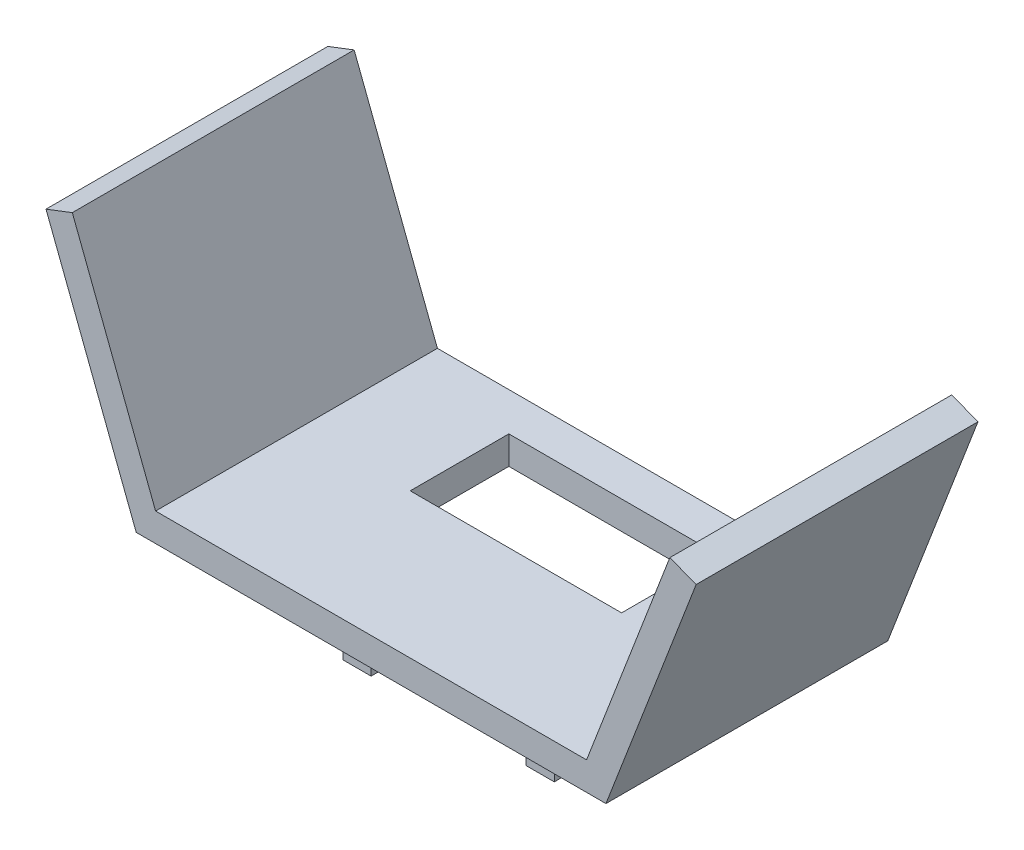
ISO-10303-21;
HEADER;
FILE_DESCRIPTION(('STEP AP214'),'2;1');
FILE_NAME('part.step','',(''),(''),'','','');
FILE_SCHEMA(('AUTOMOTIVE_DESIGN { 1 0 10303 214 1 1 1 1 }'));
ENDSEC;
DATA;
#1=APPLICATION_CONTEXT('core data for automotive mechanical design processes');
#2=APPLICATION_PROTOCOL_DEFINITION('international standard','automotive_design',2000,#1);
#3=PRODUCT_CONTEXT('',#1,'mechanical');
#4=PRODUCT('Part','Part','',(#3));
#5=PRODUCT_RELATED_PRODUCT_CATEGORY('part','',(#4));
#6=PRODUCT_DEFINITION_FORMATION('','',#4);
#7=PRODUCT_DEFINITION_CONTEXT('part definition',#1,'design');
#8=PRODUCT_DEFINITION('design','',#6,#7);
#9=PRODUCT_DEFINITION_SHAPE('','',#8);
#10=(LENGTH_UNIT() NAMED_UNIT(*) SI_UNIT(.MILLI.,.METRE.));
#11=(NAMED_UNIT(*) PLANE_ANGLE_UNIT() SI_UNIT($,.RADIAN.));
#12=(NAMED_UNIT(*) SI_UNIT($,.STERADIAN.) SOLID_ANGLE_UNIT());
#13=UNCERTAINTY_MEASURE_WITH_UNIT(LENGTH_MEASURE(1.E-05),#10,'distance_accuracy_value','');
#14=(GEOMETRIC_REPRESENTATION_CONTEXT(3) GLOBAL_UNCERTAINTY_ASSIGNED_CONTEXT((#13)) GLOBAL_UNIT_ASSIGNED_CONTEXT((#10,
#11,#12)) REPRESENTATION_CONTEXT('',''));
#15=CARTESIAN_POINT('',(0.,0.,0.));
#16=DIRECTION('',(0.,0.,1.));
#17=DIRECTION('',(1.,0.,0.));
#18=AXIS2_PLACEMENT_3D('',#15,#16,#17);
#19=CARTESIAN_POINT('',(50.,0.,60.));
#20=DIRECTION('',(0.,1.,0.));
#21=DIRECTION('',(0.,0.,1.));
#22=AXIS2_PLACEMENT_3D('',#19,#20,#21);
#23=PLANE('',#22);
#24=DIRECTION('',(-1.,0.,0.));
#25=VECTOR('',#24,1.);
#26=CARTESIAN_POINT('',(-16.5,0.,43.5));
#27=LINE('',#26,#25);
#28=CARTESIAN_POINT('',(-16.5,0.,43.5));
#29=VERTEX_POINT('',#28);
#30=CARTESIAN_POINT('',(-22.5,0.,43.5));
#31=VERTEX_POINT('',#30);
#32=EDGE_CURVE('E201',#29,#31,#27,.T.);
#33=ORIENTED_EDGE('',*,*,#32,.F.);
#34=DIRECTION('',(0.,0.,1.));
#35=VECTOR('',#34,1.);
#36=CARTESIAN_POINT('',(-16.5,0.,37.5));
#37=LINE('',#36,#35);
#38=CARTESIAN_POINT('',(-16.5,0.,37.5));
#39=VERTEX_POINT('',#38);
#40=EDGE_CURVE('E217',#39,#29,#37,.T.);
#41=ORIENTED_EDGE('',*,*,#40,.F.);
#42=DIRECTION('',(1.,0.,0.));
#43=VECTOR('',#42,1.);
#44=CARTESIAN_POINT('',(-22.5,0.,37.5));
#45=LINE('',#44,#43);
#46=CARTESIAN_POINT('',(-22.5,0.,37.5));
#47=VERTEX_POINT('',#46);
#48=EDGE_CURVE('E230',#47,#39,#45,.T.);
#49=ORIENTED_EDGE('',*,*,#48,.F.);
#50=DIRECTION('',(0.,0.,-1.));
#51=VECTOR('',#50,1.);
#52=CARTESIAN_POINT('',(-22.5,0.,43.5));
#53=LINE('',#52,#51);
#54=EDGE_CURVE('E206',#31,#47,#53,.T.);
#55=ORIENTED_EDGE('',*,*,#54,.F.);
#56=EDGE_LOOP('',(#33,#41,#49,#55));
#57=FACE_BOUND('',#56,.T.);
#58=DIRECTION('',(1.,0.,0.));
#59=VECTOR('',#58,1.);
#60=CARTESIAN_POINT('',(22.5,0.,8.16910987885628));
#61=LINE('',#60,#59);
#62=CARTESIAN_POINT('',(-22.5,0.,8.16910987885628));
#63=VERTEX_POINT('',#62);
#64=CARTESIAN_POINT('',(22.5,0.,8.16910987885628));
#65=VERTEX_POINT('',#64);
#66=EDGE_CURVE('E273',#63,#65,#61,.T.);
#67=ORIENTED_EDGE('',*,*,#66,.F.);
#68=DIRECTION('',(0.,0.,-1.));
#69=VECTOR('',#68,1.);
#70=CARTESIAN_POINT('',(-22.5,0.,8.16910987885628));
#71=LINE('',#70,#69);
#72=CARTESIAN_POINT('',(-22.5,0.,29.1691098788563));
#73=VERTEX_POINT('',#72);
#74=EDGE_CURVE('E252',#73,#63,#71,.T.);
#75=ORIENTED_EDGE('',*,*,#74,.F.);
#76=DIRECTION('',(-1.,0.,0.));
#77=VECTOR('',#76,1.);
#78=CARTESIAN_POINT('',(-22.5,0.,29.1691098788563));
#79=LINE('',#78,#77);
#80=CARTESIAN_POINT('',(22.5,0.,29.1691098788563));
#81=VERTEX_POINT('',#80);
#82=EDGE_CURVE('E258',#81,#73,#79,.T.);
#83=ORIENTED_EDGE('',*,*,#82,.F.);
#84=DIRECTION('',(0.,0.,1.));
#85=VECTOR('',#84,1.);
#86=CARTESIAN_POINT('',(22.5,0.,8.16910987885628));
#87=LINE('',#86,#85);
#88=EDGE_CURVE('E277',#65,#81,#87,.T.);
#89=ORIENTED_EDGE('',*,*,#88,.F.);
#90=EDGE_LOOP('',(#67,#75,#83,#89));
#91=FACE_BOUND('',#90,.T.);
#92=DIRECTION('',(1.,0.,0.));
#93=VECTOR('',#92,1.);
#94=CARTESIAN_POINT('',(50.,0.,0.));
#95=LINE('',#94,#93);
#96=CARTESIAN_POINT('',(-50.,0.,0.));
#97=VERTEX_POINT('',#96);
#98=CARTESIAN_POINT('',(50.,0.,0.));
#99=VERTEX_POINT('',#98);
#100=EDGE_CURVE('E327',#97,#99,#95,.T.);
#101=ORIENTED_EDGE('',*,*,#100,.T.);
#102=DIRECTION('',(0.,0.,-1.));
#103=VECTOR('',#102,1.);
#104=CARTESIAN_POINT('',(50.,0.,60.));
#105=LINE('',#104,#103);
#106=CARTESIAN_POINT('',(50.,0.,60.));
#107=VERTEX_POINT('',#106);
#108=EDGE_CURVE('E48',#107,#99,#105,.T.);
#109=ORIENTED_EDGE('',*,*,#108,.F.);
#110=DIRECTION('',(1.,0.,0.));
#111=VECTOR('',#110,1.);
#112=CARTESIAN_POINT('',(50.,0.,60.));
#113=LINE('',#112,#111);
#114=CARTESIAN_POINT('',(-50.,0.,60.));
#115=VERTEX_POINT('',#114);
#116=EDGE_CURVE('E301',#115,#107,#113,.T.);
#117=ORIENTED_EDGE('',*,*,#116,.F.);
#118=DIRECTION('',(0.,0.,-1.));
#119=VECTOR('',#118,1.);
#120=CARTESIAN_POINT('',(-50.,0.,60.));
#121=LINE('',#120,#119);
#122=EDGE_CURVE('E11',#115,#97,#121,.T.);
#123=ORIENTED_EDGE('',*,*,#122,.T.);
#124=EDGE_LOOP('',(#101,#109,#117,#123));
#125=FACE_BOUND('',#124,.T.);
#126=DIRECTION('',(0.,0.,-1.));
#127=VECTOR('',#126,1.);
#128=CARTESIAN_POINT('',(16.5,0.,37.5));
#129=LINE('',#128,#127);
#130=CARTESIAN_POINT('',(16.5,0.,43.5));
#131=VERTEX_POINT('',#130);
#132=CARTESIAN_POINT('',(16.5,0.,37.5));
#133=VERTEX_POINT('',#132);
#134=EDGE_CURVE('E199',#131,#133,#129,.T.);
#135=ORIENTED_EDGE('',*,*,#134,.F.);
#136=DIRECTION('',(-1.,0.,0.));
#137=VECTOR('',#136,1.);
#138=CARTESIAN_POINT('',(16.5,0.,43.5));
#139=LINE('',#138,#137);
#140=CARTESIAN_POINT('',(22.5,0.,43.5));
#141=VERTEX_POINT('',#140);
#142=EDGE_CURVE('E196',#141,#131,#139,.T.);
#143=ORIENTED_EDGE('',*,*,#142,.F.);
#144=DIRECTION('',(0.,0.,1.));
#145=VECTOR('',#144,1.);
#146=CARTESIAN_POINT('',(22.5,0.,43.5));
#147=LINE('',#146,#145);
#148=CARTESIAN_POINT('',(22.5,0.,37.5));
#149=VERTEX_POINT('',#148);
#150=EDGE_CURVE('E60',#149,#141,#147,.T.);
#151=ORIENTED_EDGE('',*,*,#150,.F.);
#152=DIRECTION('',(1.,0.,0.));
#153=VECTOR('',#152,1.);
#154=CARTESIAN_POINT('',(22.5,0.,37.5));
#155=LINE('',#154,#153);
#156=EDGE_CURVE('E55',#133,#149,#155,.T.);
#157=ORIENTED_EDGE('',*,*,#156,.F.);
#158=EDGE_LOOP('',(#135,#143,#151,#157));
#159=FACE_BOUND('',#158,.T.);
#160=ADVANCED_FACE('F39',(#57,#91,#125,#159),#23,.F.);
#161=CARTESIAN_POINT('',(-50.,0.,60.));
#162=DIRECTION('',(0.93349549278669,0.358589131105412,0.));
#163=DIRECTION('',(-0.358589131105412,0.93349549278669,0.));
#164=AXIS2_PLACEMENT_3D('',#161,#162,#163);
#165=PLANE('',#164);
#166=DIRECTION('',(0.358589131105412,-0.93349549278669,0.));
#167=VECTOR('',#166,1.);
#168=CARTESIAN_POINT('',(-50.,0.,0.));
#169=LINE('',#168,#167);
#170=CARTESIAN_POINT('',(-69.2067949913151,50.,0.));
#171=VERTEX_POINT('',#170);
#172=EDGE_CURVE('E287',#171,#97,#169,.T.);
#173=ORIENTED_EDGE('',*,*,#172,.T.);
#174=ORIENTED_EDGE('',*,*,#122,.F.);
#175=DIRECTION('',(0.358589131105412,-0.93349549278669,0.));
#176=VECTOR('',#175,1.);
#177=CARTESIAN_POINT('',(-50.,0.,60.));
#178=LINE('',#177,#176);
#179=CARTESIAN_POINT('',(-69.2067949913151,50.,60.));
#180=VERTEX_POINT('',#179);
#181=EDGE_CURVE('E297',#180,#115,#178,.T.);
#182=ORIENTED_EDGE('',*,*,#181,.F.);
#183=DIRECTION('',(0.,0.,-1.));
#184=VECTOR('',#183,1.);
#185=CARTESIAN_POINT('',(-69.2067949913151,50.,60.));
#186=LINE('',#185,#184);
#187=EDGE_CURVE('E323',#180,#171,#186,.T.);
#188=ORIENTED_EDGE('',*,*,#187,.T.);
#189=EDGE_LOOP('',(#173,#174,#182,#188));
#190=FACE_BOUND('',#189,.T.);
#191=ADVANCED_FACE('F41',(#190),#165,.F.);
#192=CARTESIAN_POINT('',(50.,0.,60.));
#193=DIRECTION('',(-0.93349549278669,0.358589131105412,0.));
#194=DIRECTION('',(-0.358589131105412,-0.93349549278669,0.));
#195=AXIS2_PLACEMENT_3D('',#192,#193,#194);
#196=PLANE('',#195);
#197=DIRECTION('',(0.358589131105412,0.93349549278669,0.));
#198=VECTOR('',#197,1.);
#199=CARTESIAN_POINT('',(50.,0.,0.));
#200=LINE('',#199,#198);
#201=CARTESIAN_POINT('',(69.2067949913151,50.,0.));
#202=VERTEX_POINT('',#201);
#203=EDGE_CURVE('E330',#99,#202,#200,.T.);
#204=ORIENTED_EDGE('',*,*,#203,.T.);
#205=DIRECTION('',(0.,0.,-1.));
#206=VECTOR('',#205,1.);
#207=CARTESIAN_POINT('',(69.2067949913151,50.,60.));
#208=LINE('',#207,#206);
#209=CARTESIAN_POINT('',(69.2067949913151,50.,60.));
#210=VERTEX_POINT('',#209);
#211=EDGE_CURVE('E366',#210,#202,#208,.T.);
#212=ORIENTED_EDGE('',*,*,#211,.F.);
#213=DIRECTION('',(0.358589131105412,0.93349549278669,0.));
#214=VECTOR('',#213,1.);
#215=CARTESIAN_POINT('',(50.,0.,60.));
#216=LINE('',#215,#214);
#217=EDGE_CURVE('E305',#107,#210,#216,.T.);
#218=ORIENTED_EDGE('',*,*,#217,.F.);
#219=ORIENTED_EDGE('',*,*,#108,.T.);
#220=EDGE_LOOP('',(#204,#212,#218,#219));
#221=FACE_BOUND('',#220,.T.);
#222=ADVANCED_FACE('F375',(#221),#196,.F.);
#223=CARTESIAN_POINT('',(69.2067949913151,50.,60.));
#224=DIRECTION('',(-0.358589131105414,-0.93349549278669,0.));
#225=DIRECTION('',(0.93349549278669,-0.358589131105414,0.));
#226=AXIS2_PLACEMENT_3D('',#223,#224,#225);
#227=PLANE('',#226);
#228=DIRECTION('',(-0.93349549278669,0.358589131105414,0.));
#229=VECTOR('',#228,1.);
#230=CARTESIAN_POINT('',(69.2067949913151,50.,0.));
#231=LINE('',#230,#229);
#232=CARTESIAN_POINT('',(63.6058220345949,52.1515347866325,0.));
#233=VERTEX_POINT('',#232);
#234=EDGE_CURVE('E333',#202,#233,#231,.T.);
#235=ORIENTED_EDGE('',*,*,#234,.T.);
#236=DIRECTION('',(0.,0.,-1.));
#237=VECTOR('',#236,1.);
#238=CARTESIAN_POINT('',(63.6058220345949,52.1515347866325,60.));
#239=LINE('',#238,#237);
#240=CARTESIAN_POINT('',(63.6058220345949,52.1515347866325,60.));
#241=VERTEX_POINT('',#240);
#242=EDGE_CURVE('E362',#241,#233,#239,.T.);
#243=ORIENTED_EDGE('',*,*,#242,.F.);
#244=DIRECTION('',(-0.93349549278669,0.358589131105414,0.));
#245=VECTOR('',#244,1.);
#246=CARTESIAN_POINT('',(69.2067949913151,50.,60.));
#247=LINE('',#246,#245);
#248=EDGE_CURVE('E308',#210,#241,#247,.T.);
#249=ORIENTED_EDGE('',*,*,#248,.F.);
#250=ORIENTED_EDGE('',*,*,#211,.T.);
#251=EDGE_LOOP('',(#235,#243,#249,#250));
#252=FACE_BOUND('',#251,.T.);
#253=ADVANCED_FACE('F386',(#252),#227,.F.);
#254=CARTESIAN_POINT('',(63.6058220345949,52.1515347866325,60.));
#255=DIRECTION('',(0.93349549278669,-0.358589131105412,0.));
#256=DIRECTION('',(0.358589131105412,0.93349549278669,0.));
#257=AXIS2_PLACEMENT_3D('',#254,#255,#256);
#258=PLANE('',#257);
#259=DIRECTION('',(-0.358589131105412,-0.93349549278669,0.));
#260=VECTOR('',#259,1.);
#261=CARTESIAN_POINT('',(63.6058220345949,52.1515347866325,0.));
#262=LINE('',#261,#260);
#263=CARTESIAN_POINT('',(45.877360690967,5.99999999999999,0.));
#264=VERTEX_POINT('',#263);
#265=EDGE_CURVE('E336',#233,#264,#262,.T.);
#266=ORIENTED_EDGE('',*,*,#265,.T.);
#267=DIRECTION('',(0.,0.,-1.));
#268=VECTOR('',#267,1.);
#269=CARTESIAN_POINT('',(45.877360690967,5.99999999999999,60.));
#270=LINE('',#269,#268);
#271=CARTESIAN_POINT('',(45.877360690967,5.99999999999999,60.));
#272=VERTEX_POINT('',#271);
#273=EDGE_CURVE('E358',#272,#264,#270,.T.);
#274=ORIENTED_EDGE('',*,*,#273,.F.);
#275=DIRECTION('',(-0.358589131105412,-0.93349549278669,0.));
#276=VECTOR('',#275,1.);
#277=CARTESIAN_POINT('',(63.6058220345949,52.1515347866325,60.));
#278=LINE('',#277,#276);
#279=EDGE_CURVE('E311',#241,#272,#278,.T.);
#280=ORIENTED_EDGE('',*,*,#279,.F.);
#281=ORIENTED_EDGE('',*,*,#242,.T.);
#282=EDGE_LOOP('',(#266,#274,#280,#281));
#283=FACE_BOUND('',#282,.T.);
#284=ADVANCED_FACE('F390',(#283),#258,.F.);
#285=CARTESIAN_POINT('',(-45.877360690967,5.99999999999999,60.));
#286=DIRECTION('',(0.,-1.,0.));
#287=DIRECTION('',(0.,0.,-1.));
#288=AXIS2_PLACEMENT_3D('',#285,#286,#287);
#289=PLANE('',#288);
#290=DIRECTION('',(-1.,0.,0.));
#291=VECTOR('',#290,1.);
#292=CARTESIAN_POINT('',(-22.5,6.,29.1691098788563));
#293=LINE('',#292,#291);
#294=CARTESIAN_POINT('',(22.5,6.,29.1691098788563));
#295=VERTEX_POINT('',#294);
#296=CARTESIAN_POINT('',(-22.5,6.,29.1691098788563));
#297=VERTEX_POINT('',#296);
#298=EDGE_CURVE('E266',#295,#297,#293,.T.);
#299=ORIENTED_EDGE('',*,*,#298,.T.);
#300=DIRECTION('',(0.,0.,-1.));
#301=VECTOR('',#300,1.);
#302=CARTESIAN_POINT('',(-22.5,6.,8.16910987885628));
#303=LINE('',#302,#301);
#304=CARTESIAN_POINT('',(-22.5,6.,8.16910987885628));
#305=VERTEX_POINT('',#304);
#306=EDGE_CURVE('E253',#297,#305,#303,.T.);
#307=ORIENTED_EDGE('',*,*,#306,.T.);
#308=DIRECTION('',(1.,0.,0.));
#309=VECTOR('',#308,1.);
#310=CARTESIAN_POINT('',(22.5,6.,8.16910987885628));
#311=LINE('',#310,#309);
#312=CARTESIAN_POINT('',(22.5,5.99999999999999,8.16910987885628));
#313=VERTEX_POINT('',#312);
#314=EDGE_CURVE('E257',#305,#313,#311,.T.);
#315=ORIENTED_EDGE('',*,*,#314,.T.);
#316=DIRECTION('',(0.,0.,1.));
#317=VECTOR('',#316,1.);
#318=CARTESIAN_POINT('',(22.5,6.,8.16910987885628));
#319=LINE('',#318,#317);
#320=EDGE_CURVE('E262',#313,#295,#319,.T.);
#321=ORIENTED_EDGE('',*,*,#320,.T.);
#322=EDGE_LOOP('',(#299,#307,#315,#321));
#323=FACE_BOUND('',#322,.T.);
#324=DIRECTION('',(-1.,0.,0.));
#325=VECTOR('',#324,1.);
#326=CARTESIAN_POINT('',(-45.877360690967,5.99999999999999,0.));
#327=LINE('',#326,#325);
#328=CARTESIAN_POINT('',(-45.877360690967,5.99999999999999,0.));
#329=VERTEX_POINT('',#328);
#330=EDGE_CURVE('E339',#264,#329,#327,.T.);
#331=ORIENTED_EDGE('',*,*,#330,.T.);
#332=DIRECTION('',(0.,0.,-1.));
#333=VECTOR('',#332,1.);
#334=CARTESIAN_POINT('',(-45.877360690967,5.99999999999999,60.));
#335=LINE('',#334,#333);
#336=CARTESIAN_POINT('',(-45.877360690967,5.99999999999999,60.));
#337=VERTEX_POINT('',#336);
#338=EDGE_CURVE('E354',#337,#329,#335,.T.);
#339=ORIENTED_EDGE('',*,*,#338,.F.);
#340=DIRECTION('',(-1.,0.,0.));
#341=VECTOR('',#340,1.);
#342=CARTESIAN_POINT('',(-45.877360690967,5.99999999999999,60.));
#343=LINE('',#342,#341);
#344=EDGE_CURVE('E314',#272,#337,#343,.T.);
#345=ORIENTED_EDGE('',*,*,#344,.F.);
#346=ORIENTED_EDGE('',*,*,#273,.T.);
#347=EDGE_LOOP('',(#331,#339,#345,#346));
#348=FACE_BOUND('',#347,.T.);
#349=ADVANCED_FACE('F410',(#323,#348),#289,.F.);
#350=CARTESIAN_POINT('',(-63.6058220345949,52.1515347866325,60.));
#351=DIRECTION('',(-0.93349549278669,-0.358589131105412,0.));
#352=DIRECTION('',(0.358589131105412,-0.93349549278669,0.));
#353=AXIS2_PLACEMENT_3D('',#350,#351,#352);
#354=PLANE('',#353);
#355=DIRECTION('',(-0.358589131105412,0.93349549278669,0.));
#356=VECTOR('',#355,1.);
#357=CARTESIAN_POINT('',(-63.6058220345949,52.1515347866325,0.));
#358=LINE('',#357,#356);
#359=CARTESIAN_POINT('',(-63.6058220345949,52.1515347866325,0.));
#360=VERTEX_POINT('',#359);
#361=EDGE_CURVE('E342',#329,#360,#358,.T.);
#362=ORIENTED_EDGE('',*,*,#361,.T.);
#363=DIRECTION('',(0.,0.,-1.));
#364=VECTOR('',#363,1.);
#365=CARTESIAN_POINT('',(-63.6058220345949,52.1515347866325,60.));
#366=LINE('',#365,#364);
#367=CARTESIAN_POINT('',(-63.6058220345949,52.1515347866325,60.));
#368=VERTEX_POINT('',#367);
#369=EDGE_CURVE('E350',#368,#360,#366,.T.);
#370=ORIENTED_EDGE('',*,*,#369,.F.);
#371=DIRECTION('',(-0.358589131105412,0.93349549278669,0.));
#372=VECTOR('',#371,1.);
#373=CARTESIAN_POINT('',(-63.6058220345949,52.1515347866325,60.));
#374=LINE('',#373,#372);
#375=EDGE_CURVE('E317',#337,#368,#374,.T.);
#376=ORIENTED_EDGE('',*,*,#375,.F.);
#377=ORIENTED_EDGE('',*,*,#338,.T.);
#378=EDGE_LOOP('',(#362,#370,#376,#377));
#379=FACE_BOUND('',#378,.T.);
#380=ADVANCED_FACE('F408',(#379),#354,.F.);
#381=CARTESIAN_POINT('',(-69.2067949913151,50.,60.));
#382=DIRECTION('',(0.358589131105414,-0.93349549278669,0.));
#383=DIRECTION('',(0.93349549278669,0.358589131105414,0.));
#384=AXIS2_PLACEMENT_3D('',#381,#382,#383);
#385=PLANE('',#384);
#386=DIRECTION('',(-0.93349549278669,-0.358589131105414,0.));
#387=VECTOR('',#386,1.);
#388=CARTESIAN_POINT('',(-69.2067949913151,50.,0.));
#389=LINE('',#388,#387);
#390=EDGE_CURVE('E302',#360,#171,#389,.T.);
#391=ORIENTED_EDGE('',*,*,#390,.T.);
#392=ORIENTED_EDGE('',*,*,#187,.F.);
#393=DIRECTION('',(-0.93349549278669,-0.358589131105414,0.));
#394=VECTOR('',#393,1.);
#395=CARTESIAN_POINT('',(-69.2067949913151,50.,60.));
#396=LINE('',#395,#394);
#397=EDGE_CURVE('E320',#368,#180,#396,.T.);
#398=ORIENTED_EDGE('',*,*,#397,.F.);
#399=ORIENTED_EDGE('',*,*,#369,.T.);
#400=EDGE_LOOP('',(#391,#392,#398,#399));
#401=FACE_BOUND('',#400,.T.);
#402=ADVANCED_FACE('F403',(#401),#385,.F.);
#403=CARTESIAN_POINT('',(0.,0.,60.));
#404=DIRECTION('',(0.,0.,-1.));
#405=DIRECTION('',(-1.,0.,0.));
#406=AXIS2_PLACEMENT_3D('',#403,#404,#405);
#407=PLANE('',#406);
#408=ORIENTED_EDGE('',*,*,#181,.T.);
#409=ORIENTED_EDGE('',*,*,#116,.T.);
#410=ORIENTED_EDGE('',*,*,#217,.T.);
#411=ORIENTED_EDGE('',*,*,#248,.T.);
#412=ORIENTED_EDGE('',*,*,#279,.T.);
#413=ORIENTED_EDGE('',*,*,#344,.T.);
#414=ORIENTED_EDGE('',*,*,#375,.T.);
#415=ORIENTED_EDGE('',*,*,#397,.T.);
#416=EDGE_LOOP('',(#408,#409,#410,#411,#412,#413,#414,#415));
#417=FACE_BOUND('',#416,.T.);
#418=ADVANCED_FACE('F394',(#417),#407,.F.);
#419=CARTESIAN_POINT('',(0.,0.,0.));
#420=DIRECTION('',(0.,0.,-1.));
#421=DIRECTION('',(-1.,0.,0.));
#422=AXIS2_PLACEMENT_3D('',#419,#420,#421);
#423=PLANE('',#422);
#424=ORIENTED_EDGE('',*,*,#172,.F.);
#425=ORIENTED_EDGE('',*,*,#390,.F.);
#426=ORIENTED_EDGE('',*,*,#361,.F.);
#427=ORIENTED_EDGE('',*,*,#330,.F.);
#428=ORIENTED_EDGE('',*,*,#265,.F.);
#429=ORIENTED_EDGE('',*,*,#234,.F.);
#430=ORIENTED_EDGE('',*,*,#203,.F.);
#431=ORIENTED_EDGE('',*,*,#100,.F.);
#432=EDGE_LOOP('',(#424,#425,#426,#427,#428,#429,#430,#431));
#433=FACE_BOUND('',#432,.T.);
#434=ADVANCED_FACE('F381',(#433),#423,.T.);
#435=CARTESIAN_POINT('',(-22.5,6.,8.16910987885628));
#436=DIRECTION('',(-1.,0.,0.));
#437=DIRECTION('',(0.,0.,1.));
#438=AXIS2_PLACEMENT_3D('',#435,#436,#437);
#439=PLANE('',#438);
#440=ORIENTED_EDGE('',*,*,#74,.T.);
#441=DIRECTION('',(0.,-1.,0.));
#442=VECTOR('',#441,1.);
#443=CARTESIAN_POINT('',(-22.5,6.,8.16910987885628));
#444=LINE('',#443,#442);
#445=EDGE_CURVE('E270',#305,#63,#444,.T.);
#446=ORIENTED_EDGE('',*,*,#445,.F.);
#447=ORIENTED_EDGE('',*,*,#306,.F.);
#448=DIRECTION('',(0.,-1.,0.));
#449=VECTOR('',#448,1.);
#450=CARTESIAN_POINT('',(-22.5,6.,29.1691098788563));
#451=LINE('',#450,#449);
#452=EDGE_CURVE('E284',#297,#73,#451,.T.);
#453=ORIENTED_EDGE('',*,*,#452,.T.);
#454=EDGE_LOOP('',(#440,#446,#447,#453));
#455=FACE_BOUND('',#454,.T.);
#456=ADVANCED_FACE('F469',(#455),#439,.F.);
#457=CARTESIAN_POINT('',(-22.5,6.,29.1691098788563));
#458=DIRECTION('',(0.,0.,1.));
#459=DIRECTION('',(1.,0.,0.));
#460=AXIS2_PLACEMENT_3D('',#457,#458,#459);
#461=PLANE('',#460);
#462=ORIENTED_EDGE('',*,*,#82,.T.);
#463=ORIENTED_EDGE('',*,*,#452,.F.);
#464=ORIENTED_EDGE('',*,*,#298,.F.);
#465=DIRECTION('',(0.,-1.,0.));
#466=VECTOR('',#465,1.);
#467=CARTESIAN_POINT('',(22.5,6.,29.1691098788563));
#468=LINE('',#467,#466);
#469=EDGE_CURVE('E288',#295,#81,#468,.T.);
#470=ORIENTED_EDGE('',*,*,#469,.T.);
#471=EDGE_LOOP('',(#462,#463,#464,#470));
#472=FACE_BOUND('',#471,.T.);
#473=ADVANCED_FACE('F482',(#472),#461,.F.);
#474=CARTESIAN_POINT('',(22.5,6.,8.16910987885628));
#475=DIRECTION('',(1.,0.,0.));
#476=DIRECTION('',(0.,0.,-1.));
#477=AXIS2_PLACEMENT_3D('',#474,#475,#476);
#478=PLANE('',#477);
#479=ORIENTED_EDGE('',*,*,#88,.T.);
#480=ORIENTED_EDGE('',*,*,#469,.F.);
#481=ORIENTED_EDGE('',*,*,#320,.F.);
#482=DIRECTION('',(0.,-1.,0.));
#483=VECTOR('',#482,1.);
#484=CARTESIAN_POINT('',(22.5,6.,8.16910987885628));
#485=LINE('',#484,#483);
#486=EDGE_CURVE('E291',#313,#65,#485,.T.);
#487=ORIENTED_EDGE('',*,*,#486,.T.);
#488=EDGE_LOOP('',(#479,#480,#481,#487));
#489=FACE_BOUND('',#488,.T.);
#490=ADVANCED_FACE('F492',(#489),#478,.F.);
#491=CARTESIAN_POINT('',(22.5,6.,8.16910987885628));
#492=DIRECTION('',(0.,0.,-1.));
#493=DIRECTION('',(-1.,0.,0.));
#494=AXIS2_PLACEMENT_3D('',#491,#492,#493);
#495=PLANE('',#494);
#496=ORIENTED_EDGE('',*,*,#66,.T.);
#497=ORIENTED_EDGE('',*,*,#486,.F.);
#498=ORIENTED_EDGE('',*,*,#314,.F.);
#499=ORIENTED_EDGE('',*,*,#445,.T.);
#500=EDGE_LOOP('',(#496,#497,#498,#499));
#501=FACE_BOUND('',#500,.T.);
#502=ADVANCED_FACE('F502',(#501),#495,.F.);
#503=CARTESIAN_POINT('',(-16.5,-18.,43.5));
#504=DIRECTION('',(0.,0.,-1.));
#505=DIRECTION('',(-1.,0.,0.));
#506=AXIS2_PLACEMENT_3D('',#503,#504,#505);
#507=PLANE('',#506);
#508=ORIENTED_EDGE('',*,*,#32,.T.);
#509=DIRECTION('',(0.,1.,0.));
#510=VECTOR('',#509,1.);
#511=CARTESIAN_POINT('',(-22.5,-18.,43.5));
#512=LINE('',#511,#510);
#513=CARTESIAN_POINT('',(-22.5,-18.,43.5));
#514=VERTEX_POINT('',#513);
#515=EDGE_CURVE('E248',#514,#31,#512,.T.);
#516=ORIENTED_EDGE('',*,*,#515,.F.);
#517=DIRECTION('',(-1.,0.,0.));
#518=VECTOR('',#517,1.);
#519=CARTESIAN_POINT('',(-16.5,-18.,43.5));
#520=LINE('',#519,#518);
#521=CARTESIAN_POINT('',(-16.5,-18.,43.5));
#522=VERTEX_POINT('',#521);
#523=EDGE_CURVE('E212',#522,#514,#520,.T.);
#524=ORIENTED_EDGE('',*,*,#523,.F.);
#525=DIRECTION('',(0.,1.,0.));
#526=VECTOR('',#525,1.);
#527=CARTESIAN_POINT('',(-16.5,-18.,43.5));
#528=LINE('',#527,#526);
#529=EDGE_CURVE('E225',#522,#29,#528,.T.);
#530=ORIENTED_EDGE('',*,*,#529,.T.);
#531=EDGE_LOOP('',(#508,#516,#524,#530));
#532=FACE_BOUND('',#531,.T.);
#533=ADVANCED_FACE('F511',(#532),#507,.F.);
#534=CARTESIAN_POINT('',(-22.5,-18.,43.5));
#535=DIRECTION('',(1.,0.,0.));
#536=DIRECTION('',(0.,0.,-1.));
#537=AXIS2_PLACEMENT_3D('',#534,#535,#536);
#538=PLANE('',#537);
#539=ORIENTED_EDGE('',*,*,#54,.T.);
#540=DIRECTION('',(0.,1.,0.));
#541=VECTOR('',#540,1.);
#542=CARTESIAN_POINT('',(-22.5,-18.,37.5));
#543=LINE('',#542,#541);
#544=CARTESIAN_POINT('',(-22.5,-18.,37.5));
#545=VERTEX_POINT('',#544);
#546=EDGE_CURVE('E244',#545,#47,#543,.T.);
#547=ORIENTED_EDGE('',*,*,#546,.F.);
#548=DIRECTION('',(0.,0.,-1.));
#549=VECTOR('',#548,1.);
#550=CARTESIAN_POINT('',(-22.5,-18.,43.5));
#551=LINE('',#550,#549);
#552=EDGE_CURVE('E216',#514,#545,#551,.T.);
#553=ORIENTED_EDGE('',*,*,#552,.F.);
#554=ORIENTED_EDGE('',*,*,#515,.T.);
#555=EDGE_LOOP('',(#539,#547,#553,#554));
#556=FACE_BOUND('',#555,.T.);
#557=ADVANCED_FACE('F526',(#556),#538,.F.);
#558=CARTESIAN_POINT('',(-22.5,-18.,37.5));
#559=DIRECTION('',(0.,0.,1.));
#560=DIRECTION('',(1.,0.,0.));
#561=AXIS2_PLACEMENT_3D('',#558,#559,#560);
#562=PLANE('',#561);
#563=ORIENTED_EDGE('',*,*,#48,.T.);
#564=DIRECTION('',(0.,1.,0.));
#565=VECTOR('',#564,1.);
#566=CARTESIAN_POINT('',(-16.5,-18.,37.5));
#567=LINE('',#566,#565);
#568=CARTESIAN_POINT('',(-16.5,-18.,37.5));
#569=VERTEX_POINT('',#568);
#570=EDGE_CURVE('E240',#569,#39,#567,.T.);
#571=ORIENTED_EDGE('',*,*,#570,.F.);
#572=DIRECTION('',(1.,0.,0.));
#573=VECTOR('',#572,1.);
#574=CARTESIAN_POINT('',(-22.5,-18.,37.5));
#575=LINE('',#574,#573);
#576=EDGE_CURVE('E220',#545,#569,#575,.T.);
#577=ORIENTED_EDGE('',*,*,#576,.F.);
#578=ORIENTED_EDGE('',*,*,#546,.T.);
#579=EDGE_LOOP('',(#563,#571,#577,#578));
#580=FACE_BOUND('',#579,.T.);
#581=ADVANCED_FACE('F536',(#580),#562,.F.);
#582=CARTESIAN_POINT('',(-16.5,-18.,37.5));
#583=DIRECTION('',(-1.,0.,0.));
#584=DIRECTION('',(0.,0.,1.));
#585=AXIS2_PLACEMENT_3D('',#582,#583,#584);
#586=PLANE('',#585);
#587=ORIENTED_EDGE('',*,*,#40,.T.);
#588=ORIENTED_EDGE('',*,*,#529,.F.);
#589=DIRECTION('',(0.,0.,1.));
#590=VECTOR('',#589,1.);
#591=CARTESIAN_POINT('',(-16.5,-18.,37.5));
#592=LINE('',#591,#590);
#593=EDGE_CURVE('E223',#569,#522,#592,.T.);
#594=ORIENTED_EDGE('',*,*,#593,.F.);
#595=ORIENTED_EDGE('',*,*,#570,.T.);
#596=EDGE_LOOP('',(#587,#588,#594,#595));
#597=FACE_BOUND('',#596,.T.);
#598=ADVANCED_FACE('F546',(#597),#586,.F.);
#599=CARTESIAN_POINT('',(0.,-18.,0.));
#600=DIRECTION('',(0.,-1.,0.));
#601=DIRECTION('',(0.,0.,-1.));
#602=AXIS2_PLACEMENT_3D('',#599,#600,#601);
#603=PLANE('',#602);
#604=ORIENTED_EDGE('',*,*,#523,.T.);
#605=ORIENTED_EDGE('',*,*,#552,.T.);
#606=ORIENTED_EDGE('',*,*,#576,.T.);
#607=ORIENTED_EDGE('',*,*,#593,.T.);
#608=EDGE_LOOP('',(#604,#605,#606,#607));
#609=FACE_BOUND('',#608,.T.);
#610=ADVANCED_FACE('F556',(#609),#603,.T.);
#611=CARTESIAN_POINT('',(16.5,-18.,37.5));
#612=DIRECTION('',(1.,0.,0.));
#613=DIRECTION('',(0.,0.,-1.));
#614=AXIS2_PLACEMENT_3D('',#611,#612,#613);
#615=PLANE('',#614);
#616=ORIENTED_EDGE('',*,*,#134,.T.);
#617=DIRECTION('',(0.,1.,0.));
#618=VECTOR('',#617,1.);
#619=CARTESIAN_POINT('',(16.5,-18.,37.5));
#620=LINE('',#619,#618);
#621=CARTESIAN_POINT('',(16.5,-18.,37.5));
#622=VERTEX_POINT('',#621);
#623=EDGE_CURVE('E178',#622,#133,#620,.T.);
#624=ORIENTED_EDGE('',*,*,#623,.F.);
#625=DIRECTION('',(0.,0.,-1.));
#626=VECTOR('',#625,1.);
#627=CARTESIAN_POINT('',(16.5,-18.,37.5));
#628=LINE('',#627,#626);
#629=CARTESIAN_POINT('',(16.5,-18.,43.5));
#630=VERTEX_POINT('',#629);
#631=EDGE_CURVE('E186',#630,#622,#628,.T.);
#632=ORIENTED_EDGE('',*,*,#631,.F.);
#633=DIRECTION('',(0.,1.,0.));
#634=VECTOR('',#633,1.);
#635=CARTESIAN_POINT('',(16.5,-18.,43.5));
#636=LINE('',#635,#634);
#637=EDGE_CURVE('E616',#630,#131,#636,.T.);
#638=ORIENTED_EDGE('',*,*,#637,.T.);
#639=EDGE_LOOP('',(#616,#624,#632,#638));
#640=FACE_BOUND('',#639,.T.);
#641=ADVANCED_FACE('F198',(#640),#615,.F.);
#642=CARTESIAN_POINT('',(22.5,-18.,37.5));
#643=DIRECTION('',(0.,0.,1.));
#644=DIRECTION('',(1.,0.,0.));
#645=AXIS2_PLACEMENT_3D('',#642,#643,#644);
#646=PLANE('',#645);
#647=ORIENTED_EDGE('',*,*,#156,.T.);
#648=DIRECTION('',(0.,1.,0.));
#649=VECTOR('',#648,1.);
#650=CARTESIAN_POINT('',(22.5,-18.,37.5));
#651=LINE('',#650,#649);
#652=CARTESIAN_POINT('',(22.5,-18.,37.5));
#653=VERTEX_POINT('',#652);
#654=EDGE_CURVE('E181',#653,#149,#651,.T.);
#655=ORIENTED_EDGE('',*,*,#654,.F.);
#656=DIRECTION('',(1.,0.,0.));
#657=VECTOR('',#656,1.);
#658=CARTESIAN_POINT('',(22.5,-18.,37.5));
#659=LINE('',#658,#657);
#660=EDGE_CURVE('E174',#622,#653,#659,.T.);
#661=ORIENTED_EDGE('',*,*,#660,.F.);
#662=ORIENTED_EDGE('',*,*,#623,.T.);
#663=EDGE_LOOP('',(#647,#655,#661,#662));
#664=FACE_BOUND('',#663,.T.);
#665=ADVANCED_FACE('F176',(#664),#646,.F.);
#666=CARTESIAN_POINT('',(22.5,-18.,43.5));
#667=DIRECTION('',(-1.,0.,0.));
#668=DIRECTION('',(0.,0.,1.));
#669=AXIS2_PLACEMENT_3D('',#666,#667,#668);
#670=PLANE('',#669);
#671=ORIENTED_EDGE('',*,*,#150,.T.);
#672=DIRECTION('',(0.,1.,0.));
#673=VECTOR('',#672,1.);
#674=CARTESIAN_POINT('',(22.5,-18.,43.5));
#675=LINE('',#674,#673);
#676=CARTESIAN_POINT('',(22.5,-18.,43.5));
#677=VERTEX_POINT('',#676);
#678=EDGE_CURVE('E208',#677,#141,#675,.T.);
#679=ORIENTED_EDGE('',*,*,#678,.F.);
#680=DIRECTION('',(0.,0.,1.));
#681=VECTOR('',#680,1.);
#682=CARTESIAN_POINT('',(22.5,-18.,43.5));
#683=LINE('',#682,#681);
#684=EDGE_CURVE('E185',#653,#677,#683,.T.);
#685=ORIENTED_EDGE('',*,*,#684,.F.);
#686=ORIENTED_EDGE('',*,*,#654,.T.);
#687=EDGE_LOOP('',(#671,#679,#685,#686));
#688=FACE_BOUND('',#687,.T.);
#689=ADVANCED_FACE('F583',(#688),#670,.F.);
#690=CARTESIAN_POINT('',(16.5,-18.,43.5));
#691=DIRECTION('',(0.,0.,-1.));
#692=DIRECTION('',(-1.,0.,0.));
#693=AXIS2_PLACEMENT_3D('',#690,#691,#692);
#694=PLANE('',#693);
#695=ORIENTED_EDGE('',*,*,#142,.T.);
#696=ORIENTED_EDGE('',*,*,#637,.F.);
#697=DIRECTION('',(-1.,0.,0.));
#698=VECTOR('',#697,1.);
#699=CARTESIAN_POINT('',(16.5,-18.,43.5));
#700=LINE('',#699,#698);
#701=EDGE_CURVE('E191',#677,#630,#700,.T.);
#702=ORIENTED_EDGE('',*,*,#701,.F.);
#703=ORIENTED_EDGE('',*,*,#678,.T.);
#704=EDGE_LOOP('',(#695,#696,#702,#703));
#705=FACE_BOUND('',#704,.T.);
#706=ADVANCED_FACE('F592',(#705),#694,.F.);
#707=CARTESIAN_POINT('',(0.,-18.,0.));
#708=DIRECTION('',(0.,1.,0.));
#709=DIRECTION('',(0.,0.,1.));
#710=AXIS2_PLACEMENT_3D('',#707,#708,#709);
#711=PLANE('',#710);
#712=ORIENTED_EDGE('',*,*,#631,.T.);
#713=ORIENTED_EDGE('',*,*,#660,.T.);
#714=ORIENTED_EDGE('',*,*,#684,.T.);
#715=ORIENTED_EDGE('',*,*,#701,.T.);
#716=EDGE_LOOP('',(#712,#713,#714,#715));
#717=FACE_BOUND('',#716,.T.);
#718=ADVANCED_FACE('F189',(#717),#711,.F.);
#719=CLOSED_SHELL('',(#160,#191,#222,#253,#284,#349,#380,#402,#418,#434,#456,#473,#490,#502,
#533,#557,#581,#598,#610,#641,#665,#689,#706,#718));
#720=MANIFOLD_SOLID_BREP('B2',#719);
#721=ADVANCED_BREP_SHAPE_REPRESENTATION('',(#18,#720),#14);
#722=SHAPE_DEFINITION_REPRESENTATION(#9,#721);
ENDSEC;
END-ISO-10303-21;
